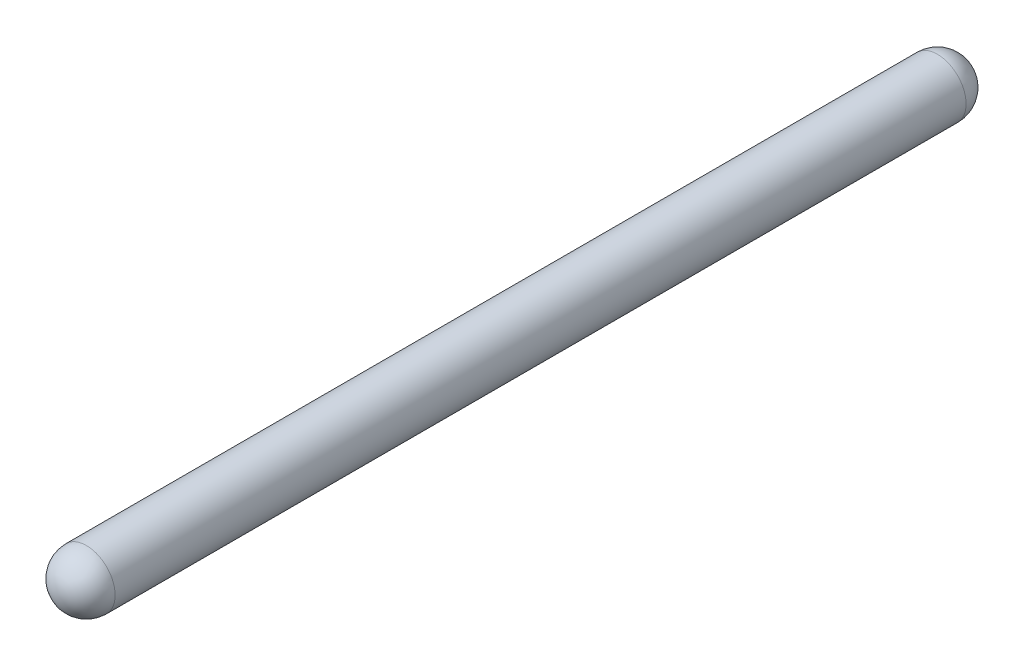
ISO-10303-21;
HEADER;
FILE_DESCRIPTION(('STEP AP214'),'2;1');
FILE_NAME('part.step','',(''),(''),'','','');
FILE_SCHEMA(('AUTOMOTIVE_DESIGN { 1 0 10303 214 1 1 1 1 }'));
ENDSEC;
DATA;
#1=APPLICATION_CONTEXT('core data for automotive mechanical design processes');
#2=APPLICATION_PROTOCOL_DEFINITION('international standard','automotive_design',2000,#1);
#3=PRODUCT_CONTEXT('',#1,'mechanical');
#4=PRODUCT('Part','Part','',(#3));
#5=PRODUCT_RELATED_PRODUCT_CATEGORY('part','',(#4));
#6=PRODUCT_DEFINITION_FORMATION('','',#4);
#7=PRODUCT_DEFINITION_CONTEXT('part definition',#1,'design');
#8=PRODUCT_DEFINITION('design','',#6,#7);
#9=PRODUCT_DEFINITION_SHAPE('','',#8);
#10=(LENGTH_UNIT() NAMED_UNIT(*) SI_UNIT(.MILLI.,.METRE.));
#11=(NAMED_UNIT(*) PLANE_ANGLE_UNIT() SI_UNIT($,.RADIAN.));
#12=(NAMED_UNIT(*) SI_UNIT($,.STERADIAN.) SOLID_ANGLE_UNIT());
#13=UNCERTAINTY_MEASURE_WITH_UNIT(LENGTH_MEASURE(1.E-05),#10,'distance_accuracy_value','');
#14=(GEOMETRIC_REPRESENTATION_CONTEXT(3) GLOBAL_UNCERTAINTY_ASSIGNED_CONTEXT((#13)) GLOBAL_UNIT_ASSIGNED_CONTEXT((#10,
#11,#12)) REPRESENTATION_CONTEXT('',''));
#15=CARTESIAN_POINT('',(0.,0.,0.));
#16=DIRECTION('',(0.,0.,1.));
#17=DIRECTION('',(1.,0.,0.));
#18=AXIS2_PLACEMENT_3D('',#15,#16,#17);
#19=CARTESIAN_POINT('',(-85.41116739722,272.8722,161.925));
#20=DIRECTION('',(0.,0.,-1.));
#21=DIRECTION('',(-1.,0.,0.));
#22=AXIS2_PLACEMENT_3D('',#19,#20,#21);
#23=CYLINDRICAL_SURFACE('',#22,10.922);
#24=CARTESIAN_POINT('',(-85.41116739722,272.8722,161.925));
#25=DIRECTION('',(0.,0.,1.));
#26=DIRECTION('',(1.,0.,0.));
#27=AXIS2_PLACEMENT_3D('',#24,#25,#26);
#28=CIRCLE('',#27,10.922);
#29=CARTESIAN_POINT('',(-74.48916739722,272.8722,161.925));
#30=VERTEX_POINT('',#29);
#31=EDGE_CURVE('E10',#30,#30,#28,.T.);
#32=ORIENTED_EDGE('',*,*,#31,.F.);
#33=EDGE_LOOP('',(#32));
#34=FACE_BOUND('',#33,.T.);
#35=CARTESIAN_POINT('',(-85.41116739722,272.8722,-161.925));
#36=DIRECTION('',(0.,0.,1.));
#37=DIRECTION('',(1.,0.,0.));
#38=AXIS2_PLACEMENT_3D('',#35,#36,#37);
#39=CIRCLE('',#38,10.922);
#40=CARTESIAN_POINT('',(-74.48916739722,272.8722,-161.925));
#41=VERTEX_POINT('',#40);
#42=EDGE_CURVE('E38',#41,#41,#39,.F.);
#43=ORIENTED_EDGE('',*,*,#42,.F.);
#44=EDGE_LOOP('',(#43));
#45=FACE_BOUND('',#44,.T.);
#46=ADVANCED_FACE('F32',(#34,#45),#23,.T.);
#47=CARTESIAN_POINT('',(-85.41116739722,272.8722,-161.925));
#48=DIRECTION('',(1.,0.,0.));
#49=DIRECTION('',(0.,1.,0.));
#50=AXIS2_PLACEMENT_3D('',#47,#48,#49);
#51=SPHERICAL_SURFACE('',#50,10.922);
#52=CARTESIAN_POINT('',(-85.41116739722,272.8722,-161.925));
#53=DIRECTION('',(0.,0.,1.));
#54=DIRECTION('',(1.,0.,0.));
#55=AXIS2_PLACEMENT_3D('',#52,#53,#54);
#56=SPHERICAL_SURFACE('',#55,10.922);
#57=ORIENTED_EDGE('',*,*,#42,.T.);
#58=EDGE_LOOP('',(#57));
#59=FACE_BOUND('',#58,.T.);
#60=ADVANCED_FACE('F44',(#59),#56,.T.);
#61=CARTESIAN_POINT('',(-85.41116739722,272.8722,161.925));
#62=DIRECTION('',(1.,0.,0.));
#63=DIRECTION('',(0.,-1.,0.));
#64=AXIS2_PLACEMENT_3D('',#61,#62,#63);
#65=SPHERICAL_SURFACE('',#64,10.922);
#66=CARTESIAN_POINT('',(-85.41116739722,272.8722,161.925));
#67=DIRECTION('',(0.,0.,1.));
#68=DIRECTION('',(1.,0.,0.));
#69=AXIS2_PLACEMENT_3D('',#66,#67,#68);
#70=SPHERICAL_SURFACE('',#69,10.922);
#71=ORIENTED_EDGE('',*,*,#31,.T.);
#72=EDGE_LOOP('',(#71));
#73=FACE_BOUND('',#72,.T.);
#74=ADVANCED_FACE('F51',(#73),#70,.T.);
#75=CLOSED_SHELL('',(#46,#60,#74));
#76=MANIFOLD_SOLID_BREP('B2',#75);
#77=ADVANCED_BREP_SHAPE_REPRESENTATION('',(#18,#76),#14);
#78=SHAPE_DEFINITION_REPRESENTATION(#9,#77);
ENDSEC;
END-ISO-10303-21;
